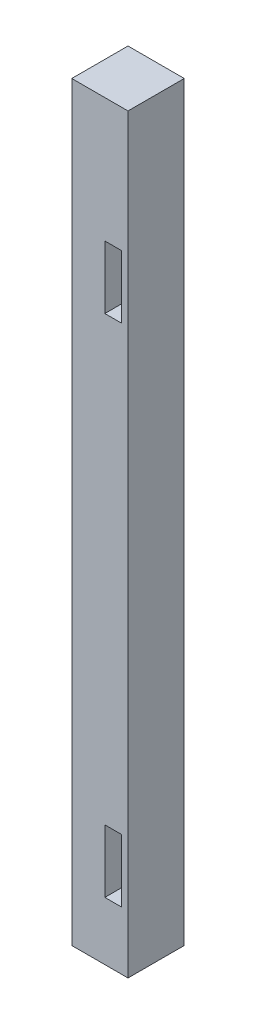
ISO-10303-21;
HEADER;
FILE_DESCRIPTION(('STEP AP214'),'2;1');
FILE_NAME('part.step','',(''),(''),'','','');
FILE_SCHEMA(('AUTOMOTIVE_DESIGN { 1 0 10303 214 1 1 1 1 }'));
ENDSEC;
DATA;
#1=APPLICATION_CONTEXT('core data for automotive mechanical design processes');
#2=APPLICATION_PROTOCOL_DEFINITION('international standard','automotive_design',2000,#1);
#3=PRODUCT_CONTEXT('',#1,'mechanical');
#4=PRODUCT('Part','Part','',(#3));
#5=PRODUCT_RELATED_PRODUCT_CATEGORY('part','',(#4));
#6=PRODUCT_DEFINITION_FORMATION('','',#4);
#7=PRODUCT_DEFINITION_CONTEXT('part definition',#1,'design');
#8=PRODUCT_DEFINITION('design','',#6,#7);
#9=PRODUCT_DEFINITION_SHAPE('','',#8);
#10=(LENGTH_UNIT() NAMED_UNIT(*) SI_UNIT(.MILLI.,.METRE.));
#11=(NAMED_UNIT(*) PLANE_ANGLE_UNIT() SI_UNIT($,.RADIAN.));
#12=(NAMED_UNIT(*) SI_UNIT($,.STERADIAN.) SOLID_ANGLE_UNIT());
#13=UNCERTAINTY_MEASURE_WITH_UNIT(LENGTH_MEASURE(1.E-05),#10,'distance_accuracy_value','');
#14=(GEOMETRIC_REPRESENTATION_CONTEXT(3) GLOBAL_UNCERTAINTY_ASSIGNED_CONTEXT((#13)) GLOBAL_UNIT_ASSIGNED_CONTEXT((#10,
#11,#12)) REPRESENTATION_CONTEXT('',''));
#15=CARTESIAN_POINT('',(0.,0.,0.));
#16=DIRECTION('',(0.,0.,1.));
#17=DIRECTION('',(1.,0.,0.));
#18=AXIS2_PLACEMENT_3D('',#15,#16,#17);
#19=CARTESIAN_POINT('',(4.25,113.5,-4.25));
#20=DIRECTION('',(-1.,0.,0.));
#21=DIRECTION('',(0.,0.,1.));
#22=AXIS2_PLACEMENT_3D('',#19,#20,#21);
#23=PLANE('',#22);
#24=DIRECTION('',(0.,0.,-1.));
#25=VECTOR('',#24,1.);
#26=CARTESIAN_POINT('',(4.25,0.,-4.25));
#27=LINE('',#26,#25);
#28=CARTESIAN_POINT('',(4.25,0.,4.25));
#29=VERTEX_POINT('',#28);
#30=CARTESIAN_POINT('',(4.25,0.,-4.25));
#31=VERTEX_POINT('',#30);
#32=EDGE_CURVE('E265',#29,#31,#27,.T.);
#33=ORIENTED_EDGE('',*,*,#32,.T.);
#34=DIRECTION('',(0.,-1.,0.));
#35=VECTOR('',#34,1.);
#36=CARTESIAN_POINT('',(4.25,113.5,-4.25));
#37=LINE('',#36,#35);
#38=CARTESIAN_POINT('',(4.25,113.5,-4.25));
#39=VERTEX_POINT('',#38);
#40=EDGE_CURVE('E11',#39,#31,#37,.T.);
#41=ORIENTED_EDGE('',*,*,#40,.F.);
#42=DIRECTION('',(0.,0.,-1.));
#43=VECTOR('',#42,1.);
#44=CARTESIAN_POINT('',(4.25,113.5,-4.25));
#45=LINE('',#44,#43);
#46=CARTESIAN_POINT('',(4.25,113.5,4.25));
#47=VERTEX_POINT('',#46);
#48=EDGE_CURVE('E302',#47,#39,#45,.T.);
#49=ORIENTED_EDGE('',*,*,#48,.F.);
#50=DIRECTION('',(0.,-1.,0.));
#51=VECTOR('',#50,1.);
#52=CARTESIAN_POINT('',(4.25,113.5,4.25));
#53=LINE('',#52,#51);
#54=EDGE_CURVE('E312',#47,#29,#53,.T.);
#55=ORIENTED_EDGE('',*,*,#54,.T.);
#56=EDGE_LOOP('',(#33,#41,#49,#55));
#57=FACE_BOUND('',#56,.T.);
#58=ADVANCED_FACE('F33',(#57),#23,.F.);
#59=CARTESIAN_POINT('',(-4.25,113.5,-4.25));
#60=DIRECTION('',(0.,0.,1.));
#61=DIRECTION('',(1.,0.,0.));
#62=AXIS2_PLACEMENT_3D('',#59,#60,#61);
#63=PLANE('',#62);
#64=DIRECTION('',(-1.,0.,0.));
#65=VECTOR('',#64,1.);
#66=CARTESIAN_POINT('',(-4.25,0.,-4.25));
#67=LINE('',#66,#65);
#68=CARTESIAN_POINT('',(-4.25,0.,-4.25));
#69=VERTEX_POINT('',#68);
#70=EDGE_CURVE('E315',#31,#69,#67,.T.);
#71=ORIENTED_EDGE('',*,*,#70,.T.);
#72=DIRECTION('',(0.,-1.,0.));
#73=VECTOR('',#72,1.);
#74=CARTESIAN_POINT('',(-4.25,113.5,-4.25));
#75=LINE('',#74,#73);
#76=CARTESIAN_POINT('',(-4.25,113.5,-4.25));
#77=VERTEX_POINT('',#76);
#78=EDGE_CURVE('E40',#77,#69,#75,.T.);
#79=ORIENTED_EDGE('',*,*,#78,.F.);
#80=DIRECTION('',(-1.,0.,0.));
#81=VECTOR('',#80,1.);
#82=CARTESIAN_POINT('',(-4.25,113.5,-4.25));
#83=LINE('',#82,#81);
#84=EDGE_CURVE('E305',#39,#77,#83,.T.);
#85=ORIENTED_EDGE('',*,*,#84,.F.);
#86=ORIENTED_EDGE('',*,*,#40,.T.);
#87=EDGE_LOOP('',(#71,#79,#85,#86));
#88=FACE_BOUND('',#87,.T.);
#89=ADVANCED_FACE('F345',(#88),#63,.F.);
#90=CARTESIAN_POINT('',(-4.25,113.5,-4.25));
#91=DIRECTION('',(1.,0.,0.));
#92=DIRECTION('',(0.,0.,-1.));
#93=AXIS2_PLACEMENT_3D('',#90,#91,#92);
#94=PLANE('',#93);
#95=DIRECTION('',(0.,0.,1.));
#96=VECTOR('',#95,1.);
#97=CARTESIAN_POINT('',(-4.25,95.2,-3.25));
#98=LINE('',#97,#96);
#99=CARTESIAN_POINT('',(-4.25,95.2,-3.25));
#100=VERTEX_POINT('',#99);
#101=CARTESIAN_POINT('',(-4.25,95.2,-0.749999999999999));
#102=VERTEX_POINT('',#101);
#103=EDGE_CURVE('E198',#100,#102,#98,.T.);
#104=ORIENTED_EDGE('',*,*,#103,.F.);
#105=DIRECTION('',(0.,-1.,0.));
#106=VECTOR('',#105,1.);
#107=CARTESIAN_POINT('',(-4.25,104.7,-3.25));
#108=LINE('',#107,#106);
#109=CARTESIAN_POINT('',(-4.25,104.7,-3.25));
#110=VERTEX_POINT('',#109);
#111=EDGE_CURVE('E47',#110,#100,#108,.T.);
#112=ORIENTED_EDGE('',*,*,#111,.F.);
#113=DIRECTION('',(0.,0.,-1.));
#114=VECTOR('',#113,1.);
#115=CARTESIAN_POINT('',(-4.25,104.7,-3.25));
#116=LINE('',#115,#114);
#117=CARTESIAN_POINT('',(-4.25,104.7,-0.750000000000001));
#118=VERTEX_POINT('',#117);
#119=EDGE_CURVE('E189',#118,#110,#116,.T.);
#120=ORIENTED_EDGE('',*,*,#119,.F.);
#121=DIRECTION('',(0.,1.,0.));
#122=VECTOR('',#121,1.);
#123=CARTESIAN_POINT('',(-4.25,104.7,-0.750000000000001));
#124=LINE('',#123,#122);
#125=EDGE_CURVE('E192',#102,#118,#124,.T.);
#126=ORIENTED_EDGE('',*,*,#125,.F.);
#127=EDGE_LOOP('',(#104,#112,#120,#126));
#128=FACE_BOUND('',#127,.T.);
#129=DIRECTION('',(0.,0.,1.));
#130=VECTOR('',#129,1.);
#131=CARTESIAN_POINT('',(-4.25,18.77,-3.25));
#132=LINE('',#131,#130);
#133=CARTESIAN_POINT('',(-4.25,18.77,-3.25));
#134=VERTEX_POINT('',#133);
#135=CARTESIAN_POINT('',(-4.25,18.77,-0.75));
#136=VERTEX_POINT('',#135);
#137=EDGE_CURVE('E224',#134,#136,#132,.T.);
#138=ORIENTED_EDGE('',*,*,#137,.F.);
#139=DIRECTION('',(0.,-1.,0.));
#140=VECTOR('',#139,1.);
#141=CARTESIAN_POINT('',(-4.25,28.27,-3.25));
#142=LINE('',#141,#140);
#143=CARTESIAN_POINT('',(-4.25,28.27,-3.25));
#144=VERTEX_POINT('',#143);
#145=EDGE_CURVE('E55',#144,#134,#142,.T.);
#146=ORIENTED_EDGE('',*,*,#145,.F.);
#147=DIRECTION('',(0.,0.,-1.));
#148=VECTOR('',#147,1.);
#149=CARTESIAN_POINT('',(-4.25,28.27,-3.25));
#150=LINE('',#149,#148);
#151=CARTESIAN_POINT('',(-4.25,28.27,-0.750000000000001));
#152=VERTEX_POINT('',#151);
#153=EDGE_CURVE('E213',#152,#144,#150,.T.);
#154=ORIENTED_EDGE('',*,*,#153,.F.);
#155=DIRECTION('',(0.,1.,0.));
#156=VECTOR('',#155,1.);
#157=CARTESIAN_POINT('',(-4.25,28.27,-0.750000000000001));
#158=LINE('',#157,#156);
#159=EDGE_CURVE('E227',#136,#152,#158,.T.);
#160=ORIENTED_EDGE('',*,*,#159,.F.);
#161=EDGE_LOOP('',(#138,#146,#154,#160));
#162=FACE_BOUND('',#161,.T.);
#163=DIRECTION('',(0.,0.,1.));
#164=VECTOR('',#163,1.);
#165=CARTESIAN_POINT('',(-4.25,0.,-4.25));
#166=LINE('',#165,#164);
#167=CARTESIAN_POINT('',(-4.25,0.,4.25));
#168=VERTEX_POINT('',#167);
#169=EDGE_CURVE('E317',#69,#168,#166,.T.);
#170=ORIENTED_EDGE('',*,*,#169,.T.);
#171=DIRECTION('',(0.,-1.,0.));
#172=VECTOR('',#171,1.);
#173=CARTESIAN_POINT('',(-4.25,113.5,4.25));
#174=LINE('',#173,#172);
#175=CARTESIAN_POINT('',(-4.25,113.5,4.25));
#176=VERTEX_POINT('',#175);
#177=EDGE_CURVE('E322',#176,#168,#174,.T.);
#178=ORIENTED_EDGE('',*,*,#177,.F.);
#179=DIRECTION('',(0.,0.,1.));
#180=VECTOR('',#179,1.);
#181=CARTESIAN_POINT('',(-4.25,113.5,-4.25));
#182=LINE('',#181,#180);
#183=EDGE_CURVE('E308',#77,#176,#182,.T.);
#184=ORIENTED_EDGE('',*,*,#183,.F.);
#185=ORIENTED_EDGE('',*,*,#78,.T.);
#186=EDGE_LOOP('',(#170,#178,#184,#185));
#187=FACE_BOUND('',#186,.T.);
#188=ADVANCED_FACE('F329',(#128,#162,#187),#94,.F.);
#189=CARTESIAN_POINT('',(-4.25,113.5,4.25));
#190=DIRECTION('',(0.,0.,-1.));
#191=DIRECTION('',(-1.,0.,0.));
#192=AXIS2_PLACEMENT_3D('',#189,#190,#191);
#193=PLANE('',#192);
#194=DIRECTION('',(-1.,0.,0.));
#195=VECTOR('',#194,1.);
#196=CARTESIAN_POINT('',(3.25,18.3,4.25));
#197=LINE('',#196,#195);
#198=CARTESIAN_POINT('',(3.25,18.3,4.25));
#199=VERTEX_POINT('',#198);
#200=CARTESIAN_POINT('',(0.750000000000003,18.3,4.25));
#201=VERTEX_POINT('',#200);
#202=EDGE_CURVE('E254',#199,#201,#197,.T.);
#203=ORIENTED_EDGE('',*,*,#202,.F.);
#204=DIRECTION('',(0.,1.,0.));
#205=VECTOR('',#204,1.);
#206=CARTESIAN_POINT('',(3.25,18.3,4.25));
#207=LINE('',#206,#205);
#208=CARTESIAN_POINT('',(3.25,8.8,4.25));
#209=VERTEX_POINT('',#208);
#210=EDGE_CURVE('E252',#209,#199,#207,.T.);
#211=ORIENTED_EDGE('',*,*,#210,.F.);
#212=DIRECTION('',(1.,0.,0.));
#213=VECTOR('',#212,1.);
#214=CARTESIAN_POINT('',(3.25,8.8,4.25));
#215=LINE('',#214,#213);
#216=CARTESIAN_POINT('',(0.750000000000003,8.8,4.25));
#217=VERTEX_POINT('',#216);
#218=EDGE_CURVE('E242',#217,#209,#215,.T.);
#219=ORIENTED_EDGE('',*,*,#218,.F.);
#220=DIRECTION('',(0.,-1.,0.));
#221=VECTOR('',#220,1.);
#222=CARTESIAN_POINT('',(0.750000000000003,18.3,4.25));
#223=LINE('',#222,#221);
#224=EDGE_CURVE('E258',#201,#217,#223,.T.);
#225=ORIENTED_EDGE('',*,*,#224,.F.);
#226=EDGE_LOOP('',(#203,#211,#219,#225));
#227=FACE_BOUND('',#226,.T.);
#228=DIRECTION('',(1.,0.,0.));
#229=VECTOR('',#228,1.);
#230=CARTESIAN_POINT('',(0.750000000000003,85.23,4.25));
#231=LINE('',#230,#229);
#232=CARTESIAN_POINT('',(0.750000000000003,85.23,4.25));
#233=VERTEX_POINT('',#232);
#234=CARTESIAN_POINT('',(3.25,85.23,4.25));
#235=VERTEX_POINT('',#234);
#236=EDGE_CURVE('E287',#233,#235,#231,.T.);
#237=ORIENTED_EDGE('',*,*,#236,.F.);
#238=DIRECTION('',(0.,-1.,0.));
#239=VECTOR('',#238,1.);
#240=CARTESIAN_POINT('',(0.750000000000002,94.73,4.25));
#241=LINE('',#240,#239);
#242=CARTESIAN_POINT('',(0.750000000000002,94.73,4.25));
#243=VERTEX_POINT('',#242);
#244=EDGE_CURVE('E205',#243,#233,#241,.T.);
#245=ORIENTED_EDGE('',*,*,#244,.F.);
#246=DIRECTION('',(-1.,0.,0.));
#247=VECTOR('',#246,1.);
#248=CARTESIAN_POINT('',(0.750000000000002,94.73,4.25));
#249=LINE('',#248,#247);
#250=CARTESIAN_POINT('',(3.25,94.73,4.25));
#251=VERTEX_POINT('',#250);
#252=EDGE_CURVE('E276',#251,#243,#249,.T.);
#253=ORIENTED_EDGE('',*,*,#252,.F.);
#254=DIRECTION('',(0.,1.,0.));
#255=VECTOR('',#254,1.);
#256=CARTESIAN_POINT('',(3.25,94.73,4.25));
#257=LINE('',#256,#255);
#258=EDGE_CURVE('E290',#235,#251,#257,.T.);
#259=ORIENTED_EDGE('',*,*,#258,.F.);
#260=EDGE_LOOP('',(#237,#245,#253,#259));
#261=FACE_BOUND('',#260,.T.);
#262=DIRECTION('',(1.,0.,0.));
#263=VECTOR('',#262,1.);
#264=CARTESIAN_POINT('',(-4.25,0.,4.25));
#265=LINE('',#264,#263);
#266=EDGE_CURVE('E306',#168,#29,#265,.T.);
#267=ORIENTED_EDGE('',*,*,#266,.T.);
#268=ORIENTED_EDGE('',*,*,#54,.F.);
#269=DIRECTION('',(1.,0.,0.));
#270=VECTOR('',#269,1.);
#271=CARTESIAN_POINT('',(-4.25,113.5,4.25));
#272=LINE('',#271,#270);
#273=EDGE_CURVE('E310',#176,#47,#272,.T.);
#274=ORIENTED_EDGE('',*,*,#273,.F.);
#275=ORIENTED_EDGE('',*,*,#177,.T.);
#276=EDGE_LOOP('',(#267,#268,#274,#275));
#277=FACE_BOUND('',#276,.T.);
#278=ADVANCED_FACE('F338',(#227,#261,#277),#193,.F.);
#279=CARTESIAN_POINT('',(0.,113.5,0.));
#280=DIRECTION('',(0.,1.,0.));
#281=DIRECTION('',(0.,0.,1.));
#282=AXIS2_PLACEMENT_3D('',#279,#280,#281);
#283=PLANE('',#282);
#284=ORIENTED_EDGE('',*,*,#48,.T.);
#285=ORIENTED_EDGE('',*,*,#84,.T.);
#286=ORIENTED_EDGE('',*,*,#183,.T.);
#287=ORIENTED_EDGE('',*,*,#273,.T.);
#288=EDGE_LOOP('',(#284,#285,#286,#287));
#289=FACE_BOUND('',#288,.T.);
#290=ADVANCED_FACE('F344',(#289),#283,.T.);
#291=CARTESIAN_POINT('',(0.,0.,0.));
#292=DIRECTION('',(0.,1.,0.));
#293=DIRECTION('',(0.,0.,1.));
#294=AXIS2_PLACEMENT_3D('',#291,#292,#293);
#295=PLANE('',#294);
#296=ORIENTED_EDGE('',*,*,#32,.F.);
#297=ORIENTED_EDGE('',*,*,#266,.F.);
#298=ORIENTED_EDGE('',*,*,#169,.F.);
#299=ORIENTED_EDGE('',*,*,#70,.F.);
#300=EDGE_LOOP('',(#296,#297,#298,#299));
#301=FACE_BOUND('',#300,.T.);
#302=ADVANCED_FACE('F335',(#301),#295,.F.);
#303=CARTESIAN_POINT('',(0.750000000000002,94.73,-0.750000000000002));
#304=DIRECTION('',(-1.,0.,0.));
#305=DIRECTION('',(0.,-1.,0.));
#306=AXIS2_PLACEMENT_3D('',#303,#304,#305);
#307=PLANE('',#306);
#308=ORIENTED_EDGE('',*,*,#244,.T.);
#309=DIRECTION('',(0.,0.,1.));
#310=VECTOR('',#309,1.);
#311=CARTESIAN_POINT('',(0.750000000000003,85.23,-0.750000000000002));
#312=LINE('',#311,#310);
#313=CARTESIAN_POINT('',(0.750000000000003,85.23,-0.750000000000002));
#314=VERTEX_POINT('',#313);
#315=EDGE_CURVE('E285',#314,#233,#312,.T.);
#316=ORIENTED_EDGE('',*,*,#315,.F.);
#317=DIRECTION('',(0.,-1.,0.));
#318=VECTOR('',#317,1.);
#319=CARTESIAN_POINT('',(0.750000000000002,94.73,-0.750000000000002));
#320=LINE('',#319,#318);
#321=CARTESIAN_POINT('',(0.750000000000002,94.73,-0.750000000000002));
#322=VERTEX_POINT('',#321);
#323=EDGE_CURVE('E272',#322,#314,#320,.T.);
#324=ORIENTED_EDGE('',*,*,#323,.F.);
#325=DIRECTION('',(0.,0.,1.));
#326=VECTOR('',#325,1.);
#327=CARTESIAN_POINT('',(0.750000000000002,94.73,-0.750000000000002));
#328=LINE('',#327,#326);
#329=EDGE_CURVE('E255',#322,#243,#328,.T.);
#330=ORIENTED_EDGE('',*,*,#329,.T.);
#331=EDGE_LOOP('',(#308,#316,#324,#330));
#332=FACE_BOUND('',#331,.T.);
#333=ADVANCED_FACE('F359',(#332),#307,.F.);
#334=CARTESIAN_POINT('',(0.750000000000002,94.73,-0.750000000000002));
#335=DIRECTION('',(0.,1.,0.));
#336=DIRECTION('',(0.,0.,1.));
#337=AXIS2_PLACEMENT_3D('',#334,#335,#336);
#338=PLANE('',#337);
#339=ORIENTED_EDGE('',*,*,#252,.T.);
#340=ORIENTED_EDGE('',*,*,#329,.F.);
#341=DIRECTION('',(-1.,0.,0.));
#342=VECTOR('',#341,1.);
#343=CARTESIAN_POINT('',(0.750000000000002,94.73,-0.750000000000002));
#344=LINE('',#343,#342);
#345=CARTESIAN_POINT('',(3.25,94.73,-0.750000000000002));
#346=VERTEX_POINT('',#345);
#347=EDGE_CURVE('E282',#346,#322,#344,.T.);
#348=ORIENTED_EDGE('',*,*,#347,.F.);
#349=DIRECTION('',(0.,0.,1.));
#350=VECTOR('',#349,1.);
#351=CARTESIAN_POINT('',(3.25,94.73,-0.750000000000002));
#352=LINE('',#351,#350);
#353=EDGE_CURVE('E296',#346,#251,#352,.T.);
#354=ORIENTED_EDGE('',*,*,#353,.T.);
#355=EDGE_LOOP('',(#339,#340,#348,#354));
#356=FACE_BOUND('',#355,.T.);
#357=ADVANCED_FACE('F364',(#356),#338,.F.);
#358=CARTESIAN_POINT('',(3.25,94.73,-0.750000000000002));
#359=DIRECTION('',(1.,0.,0.));
#360=DIRECTION('',(0.,1.,0.));
#361=AXIS2_PLACEMENT_3D('',#358,#359,#360);
#362=PLANE('',#361);
#363=ORIENTED_EDGE('',*,*,#258,.T.);
#364=ORIENTED_EDGE('',*,*,#353,.F.);
#365=DIRECTION('',(0.,1.,0.));
#366=VECTOR('',#365,1.);
#367=CARTESIAN_POINT('',(3.25,94.73,-0.750000000000002));
#368=LINE('',#367,#366);
#369=CARTESIAN_POINT('',(3.25,85.23,-0.750000000000002));
#370=VERTEX_POINT('',#369);
#371=EDGE_CURVE('E279',#370,#346,#368,.T.);
#372=ORIENTED_EDGE('',*,*,#371,.F.);
#373=DIRECTION('',(0.,0.,1.));
#374=VECTOR('',#373,1.);
#375=CARTESIAN_POINT('',(3.25,85.23,-0.750000000000002));
#376=LINE('',#375,#374);
#377=EDGE_CURVE('E298',#370,#235,#376,.T.);
#378=ORIENTED_EDGE('',*,*,#377,.T.);
#379=EDGE_LOOP('',(#363,#364,#372,#378));
#380=FACE_BOUND('',#379,.T.);
#381=ADVANCED_FACE('F370',(#380),#362,.F.);
#382=CARTESIAN_POINT('',(0.750000000000003,85.23,-0.750000000000002));
#383=DIRECTION('',(0.,-1.,0.));
#384=DIRECTION('',(0.,0.,-1.));
#385=AXIS2_PLACEMENT_3D('',#382,#383,#384);
#386=PLANE('',#385);
#387=ORIENTED_EDGE('',*,*,#236,.T.);
#388=ORIENTED_EDGE('',*,*,#377,.F.);
#389=DIRECTION('',(1.,0.,0.));
#390=VECTOR('',#389,1.);
#391=CARTESIAN_POINT('',(0.750000000000003,85.23,-0.750000000000002));
#392=LINE('',#391,#390);
#393=EDGE_CURVE('E275',#314,#370,#392,.T.);
#394=ORIENTED_EDGE('',*,*,#393,.F.);
#395=ORIENTED_EDGE('',*,*,#315,.T.);
#396=EDGE_LOOP('',(#387,#388,#394,#395));
#397=FACE_BOUND('',#396,.T.);
#398=ADVANCED_FACE('F366',(#397),#386,.F.);
#399=CARTESIAN_POINT('',(0.,0.,-0.750000000000002));
#400=DIRECTION('',(0.,0.,1.));
#401=DIRECTION('',(1.,0.,0.));
#402=AXIS2_PLACEMENT_3D('',#399,#400,#401);
#403=PLANE('',#402);
#404=ORIENTED_EDGE('',*,*,#323,.T.);
#405=ORIENTED_EDGE('',*,*,#393,.T.);
#406=ORIENTED_EDGE('',*,*,#371,.T.);
#407=ORIENTED_EDGE('',*,*,#347,.T.);
#408=EDGE_LOOP('',(#404,#405,#406,#407));
#409=FACE_BOUND('',#408,.T.);
#410=ADVANCED_FACE('F369',(#409),#403,.T.);
#411=CARTESIAN_POINT('',(3.25,18.3,-0.750000000000002));
#412=DIRECTION('',(1.,0.,0.));
#413=DIRECTION('',(0.,0.,-1.));
#414=AXIS2_PLACEMENT_3D('',#411,#412,#413);
#415=PLANE('',#414);
#416=ORIENTED_EDGE('',*,*,#210,.T.);
#417=DIRECTION('',(0.,0.,1.));
#418=VECTOR('',#417,1.);
#419=CARTESIAN_POINT('',(3.25,18.3,-0.750000000000002));
#420=LINE('',#419,#418);
#421=CARTESIAN_POINT('',(3.25,18.3,-0.750000000000002));
#422=VERTEX_POINT('',#421);
#423=EDGE_CURVE('E251',#422,#199,#420,.T.);
#424=ORIENTED_EDGE('',*,*,#423,.F.);
#425=DIRECTION('',(0.,1.,0.));
#426=VECTOR('',#425,1.);
#427=CARTESIAN_POINT('',(3.25,18.3,-0.750000000000002));
#428=LINE('',#427,#426);
#429=CARTESIAN_POINT('',(3.25,8.8,-0.750000000000002));
#430=VERTEX_POINT('',#429);
#431=EDGE_CURVE('E238',#430,#422,#428,.T.);
#432=ORIENTED_EDGE('',*,*,#431,.F.);
#433=DIRECTION('',(0.,0.,1.));
#434=VECTOR('',#433,1.);
#435=CARTESIAN_POINT('',(3.25,8.8,-0.750000000000002));
#436=LINE('',#435,#434);
#437=EDGE_CURVE('E263',#430,#209,#436,.T.);
#438=ORIENTED_EDGE('',*,*,#437,.T.);
#439=EDGE_LOOP('',(#416,#424,#432,#438));
#440=FACE_BOUND('',#439,.T.);
#441=ADVANCED_FACE('F380',(#440),#415,.F.);
#442=CARTESIAN_POINT('',(3.25,8.8,-0.750000000000002));
#443=DIRECTION('',(0.,-1.,0.));
#444=DIRECTION('',(0.,0.,-1.));
#445=AXIS2_PLACEMENT_3D('',#442,#443,#444);
#446=PLANE('',#445);
#447=ORIENTED_EDGE('',*,*,#218,.T.);
#448=ORIENTED_EDGE('',*,*,#437,.F.);
#449=DIRECTION('',(1.,0.,0.));
#450=VECTOR('',#449,1.);
#451=CARTESIAN_POINT('',(3.25,8.8,-0.750000000000002));
#452=LINE('',#451,#450);
#453=CARTESIAN_POINT('',(0.750000000000003,8.8,-0.750000000000002));
#454=VERTEX_POINT('',#453);
#455=EDGE_CURVE('E248',#454,#430,#452,.T.);
#456=ORIENTED_EDGE('',*,*,#455,.F.);
#457=DIRECTION('',(0.,0.,1.));
#458=VECTOR('',#457,1.);
#459=CARTESIAN_POINT('',(0.750000000000003,8.8,-0.750000000000002));
#460=LINE('',#459,#458);
#461=EDGE_CURVE('E266',#454,#217,#460,.T.);
#462=ORIENTED_EDGE('',*,*,#461,.T.);
#463=EDGE_LOOP('',(#447,#448,#456,#462));
#464=FACE_BOUND('',#463,.T.);
#465=ADVANCED_FACE('F384',(#464),#446,.F.);
#466=CARTESIAN_POINT('',(0.750000000000003,18.3,-0.750000000000002));
#467=DIRECTION('',(-1.,0.,0.));
#468=DIRECTION('',(0.,-1.,0.));
#469=AXIS2_PLACEMENT_3D('',#466,#467,#468);
#470=PLANE('',#469);
#471=ORIENTED_EDGE('',*,*,#224,.T.);
#472=ORIENTED_EDGE('',*,*,#461,.F.);
#473=DIRECTION('',(0.,-1.,0.));
#474=VECTOR('',#473,1.);
#475=CARTESIAN_POINT('',(0.750000000000003,18.3,-0.750000000000002));
#476=LINE('',#475,#474);
#477=CARTESIAN_POINT('',(0.750000000000003,18.3,-0.750000000000002));
#478=VERTEX_POINT('',#477);
#479=EDGE_CURVE('E245',#478,#454,#476,.T.);
#480=ORIENTED_EDGE('',*,*,#479,.F.);
#481=DIRECTION('',(0.,0.,1.));
#482=VECTOR('',#481,1.);
#483=CARTESIAN_POINT('',(0.750000000000003,18.3,-0.750000000000002));
#484=LINE('',#483,#482);
#485=EDGE_CURVE('E268',#478,#201,#484,.T.);
#486=ORIENTED_EDGE('',*,*,#485,.T.);
#487=EDGE_LOOP('',(#471,#472,#480,#486));
#488=FACE_BOUND('',#487,.T.);
#489=ADVANCED_FACE('F390',(#488),#470,.F.);
#490=CARTESIAN_POINT('',(3.25,18.3,-0.750000000000002));
#491=DIRECTION('',(0.,1.,0.));
#492=DIRECTION('',(0.,0.,1.));
#493=AXIS2_PLACEMENT_3D('',#490,#491,#492);
#494=PLANE('',#493);
#495=ORIENTED_EDGE('',*,*,#202,.T.);
#496=ORIENTED_EDGE('',*,*,#485,.F.);
#497=DIRECTION('',(-1.,0.,0.));
#498=VECTOR('',#497,1.);
#499=CARTESIAN_POINT('',(3.25,18.3,-0.750000000000002));
#500=LINE('',#499,#498);
#501=EDGE_CURVE('E241',#422,#478,#500,.T.);
#502=ORIENTED_EDGE('',*,*,#501,.F.);
#503=ORIENTED_EDGE('',*,*,#423,.T.);
#504=EDGE_LOOP('',(#495,#496,#502,#503));
#505=FACE_BOUND('',#504,.T.);
#506=ADVANCED_FACE('F386',(#505),#494,.F.);
#507=CARTESIAN_POINT('',(0.,0.,-0.750000000000002));
#508=DIRECTION('',(0.,0.,-1.));
#509=DIRECTION('',(-1.,0.,0.));
#510=AXIS2_PLACEMENT_3D('',#507,#508,#509);
#511=PLANE('',#510);
#512=ORIENTED_EDGE('',*,*,#431,.T.);
#513=ORIENTED_EDGE('',*,*,#501,.T.);
#514=ORIENTED_EDGE('',*,*,#479,.T.);
#515=ORIENTED_EDGE('',*,*,#455,.T.);
#516=EDGE_LOOP('',(#512,#513,#514,#515));
#517=FACE_BOUND('',#516,.T.);
#518=ADVANCED_FACE('F389',(#517),#511,.F.);
#519=CARTESIAN_POINT('',(0.75,28.27,-3.25));
#520=DIRECTION('',(0.,0.,-1.));
#521=DIRECTION('',(-1.,0.,0.));
#522=AXIS2_PLACEMENT_3D('',#519,#520,#521);
#523=PLANE('',#522);
#524=ORIENTED_EDGE('',*,*,#145,.T.);
#525=DIRECTION('',(-1.,0.,0.));
#526=VECTOR('',#525,1.);
#527=CARTESIAN_POINT('',(0.75,18.77,-3.25));
#528=LINE('',#527,#526);
#529=CARTESIAN_POINT('',(0.75,18.77,-3.25));
#530=VERTEX_POINT('',#529);
#531=EDGE_CURVE('E222',#530,#134,#528,.T.);
#532=ORIENTED_EDGE('',*,*,#531,.F.);
#533=DIRECTION('',(0.,-1.,0.));
#534=VECTOR('',#533,1.);
#535=CARTESIAN_POINT('',(0.75,28.27,-3.25));
#536=LINE('',#535,#534);
#537=CARTESIAN_POINT('',(0.75,28.27,-3.25));
#538=VERTEX_POINT('',#537);
#539=EDGE_CURVE('E209',#538,#530,#536,.T.);
#540=ORIENTED_EDGE('',*,*,#539,.F.);
#541=DIRECTION('',(-1.,0.,0.));
#542=VECTOR('',#541,1.);
#543=CARTESIAN_POINT('',(0.75,28.27,-3.25));
#544=LINE('',#543,#542);
#545=EDGE_CURVE('E199',#538,#144,#544,.T.);
#546=ORIENTED_EDGE('',*,*,#545,.T.);
#547=EDGE_LOOP('',(#524,#532,#540,#546));
#548=FACE_BOUND('',#547,.T.);
#549=ADVANCED_FACE('F400',(#548),#523,.F.);
#550=CARTESIAN_POINT('',(0.75,28.27,-3.25));
#551=DIRECTION('',(0.,1.,0.));
#552=DIRECTION('',(0.,0.,1.));
#553=AXIS2_PLACEMENT_3D('',#550,#551,#552);
#554=PLANE('',#553);
#555=ORIENTED_EDGE('',*,*,#153,.T.);
#556=ORIENTED_EDGE('',*,*,#545,.F.);
#557=DIRECTION('',(0.,0.,-1.));
#558=VECTOR('',#557,1.);
#559=CARTESIAN_POINT('',(0.75,28.27,-3.25));
#560=LINE('',#559,#558);
#561=CARTESIAN_POINT('',(0.750000000000001,28.27,-0.750000000000002));
#562=VERTEX_POINT('',#561);
#563=EDGE_CURVE('E219',#562,#538,#560,.T.);
#564=ORIENTED_EDGE('',*,*,#563,.F.);
#565=DIRECTION('',(-1.,0.,0.));
#566=VECTOR('',#565,1.);
#567=CARTESIAN_POINT('',(0.750000000000001,28.27,-0.750000000000002));
#568=LINE('',#567,#566);
#569=EDGE_CURVE('E233',#562,#152,#568,.T.);
#570=ORIENTED_EDGE('',*,*,#569,.T.);
#571=EDGE_LOOP('',(#555,#556,#564,#570));
#572=FACE_BOUND('',#571,.T.);
#573=ADVANCED_FACE('F404',(#572),#554,.F.);
#574=CARTESIAN_POINT('',(0.750000000000001,28.27,-0.750000000000002));
#575=DIRECTION('',(0.,0.,1.));
#576=DIRECTION('',(1.,0.,0.));
#577=AXIS2_PLACEMENT_3D('',#574,#575,#576);
#578=PLANE('',#577);
#579=ORIENTED_EDGE('',*,*,#159,.T.);
#580=ORIENTED_EDGE('',*,*,#569,.F.);
#581=DIRECTION('',(0.,1.,0.));
#582=VECTOR('',#581,1.);
#583=CARTESIAN_POINT('',(0.750000000000001,28.27,-0.750000000000002));
#584=LINE('',#583,#582);
#585=CARTESIAN_POINT('',(0.750000000000001,18.77,-0.750000000000001));
#586=VERTEX_POINT('',#585);
#587=EDGE_CURVE('E216',#586,#562,#584,.T.);
#588=ORIENTED_EDGE('',*,*,#587,.F.);
#589=DIRECTION('',(-1.,0.,0.));
#590=VECTOR('',#589,1.);
#591=CARTESIAN_POINT('',(0.750000000000001,18.77,-0.750000000000001));
#592=LINE('',#591,#590);
#593=EDGE_CURVE('E235',#586,#136,#592,.T.);
#594=ORIENTED_EDGE('',*,*,#593,.T.);
#595=EDGE_LOOP('',(#579,#580,#588,#594));
#596=FACE_BOUND('',#595,.T.);
#597=ADVANCED_FACE('F409',(#596),#578,.F.);
#598=CARTESIAN_POINT('',(0.75,18.77,-3.25));
#599=DIRECTION('',(0.,-1.,0.));
#600=DIRECTION('',(0.,0.,-1.));
#601=AXIS2_PLACEMENT_3D('',#598,#599,#600);
#602=PLANE('',#601);
#603=ORIENTED_EDGE('',*,*,#137,.T.);
#604=ORIENTED_EDGE('',*,*,#593,.F.);
#605=DIRECTION('',(0.,0.,1.));
#606=VECTOR('',#605,1.);
#607=CARTESIAN_POINT('',(0.75,18.77,-3.25));
#608=LINE('',#607,#606);
#609=EDGE_CURVE('E212',#530,#586,#608,.T.);
#610=ORIENTED_EDGE('',*,*,#609,.F.);
#611=ORIENTED_EDGE('',*,*,#531,.T.);
#612=EDGE_LOOP('',(#603,#604,#610,#611));
#613=FACE_BOUND('',#612,.T.);
#614=ADVANCED_FACE('F405',(#613),#602,.F.);
#615=CARTESIAN_POINT('',(0.750000000000001,0.,0.));
#616=DIRECTION('',(-1.,0.,0.));
#617=DIRECTION('',(0.,0.,1.));
#618=AXIS2_PLACEMENT_3D('',#615,#616,#617);
#619=PLANE('',#618);
#620=ORIENTED_EDGE('',*,*,#539,.T.);
#621=ORIENTED_EDGE('',*,*,#609,.T.);
#622=ORIENTED_EDGE('',*,*,#587,.T.);
#623=ORIENTED_EDGE('',*,*,#563,.T.);
#624=EDGE_LOOP('',(#620,#621,#622,#623));
#625=FACE_BOUND('',#624,.T.);
#626=ADVANCED_FACE('F408',(#625),#619,.T.);
#627=CARTESIAN_POINT('',(0.75,104.7,-3.25));
#628=DIRECTION('',(0.,0.,-1.));
#629=DIRECTION('',(-1.,0.,0.));
#630=AXIS2_PLACEMENT_3D('',#627,#628,#629);
#631=PLANE('',#630);
#632=ORIENTED_EDGE('',*,*,#111,.T.);
#633=DIRECTION('',(-1.,0.,0.));
#634=VECTOR('',#633,1.);
#635=CARTESIAN_POINT('',(0.75,95.2,-3.25));
#636=LINE('',#635,#634);
#637=CARTESIAN_POINT('',(0.75,95.2,-3.25));
#638=VERTEX_POINT('',#637);
#639=EDGE_CURVE('E167',#638,#100,#636,.T.);
#640=ORIENTED_EDGE('',*,*,#639,.F.);
#641=DIRECTION('',(0.,-1.,0.));
#642=VECTOR('',#641,1.);
#643=CARTESIAN_POINT('',(0.75,104.7,-3.25));
#644=LINE('',#643,#642);
#645=CARTESIAN_POINT('',(0.75,104.7,-3.25));
#646=VERTEX_POINT('',#645);
#647=EDGE_CURVE('E171',#646,#638,#644,.T.);
#648=ORIENTED_EDGE('',*,*,#647,.F.);
#649=DIRECTION('',(-1.,0.,0.));
#650=VECTOR('',#649,1.);
#651=CARTESIAN_POINT('',(0.75,104.7,-3.25));
#652=LINE('',#651,#650);
#653=EDGE_CURVE('E203',#646,#110,#652,.T.);
#654=ORIENTED_EDGE('',*,*,#653,.T.);
#655=EDGE_LOOP('',(#632,#640,#648,#654));
#656=FACE_BOUND('',#655,.T.);
#657=ADVANCED_FACE('F169',(#656),#631,.F.);
#658=CARTESIAN_POINT('',(0.75,104.7,-3.25));
#659=DIRECTION('',(0.,1.,0.));
#660=DIRECTION('',(0.,0.,1.));
#661=AXIS2_PLACEMENT_3D('',#658,#659,#660);
#662=PLANE('',#661);
#663=ORIENTED_EDGE('',*,*,#119,.T.);
#664=ORIENTED_EDGE('',*,*,#653,.F.);
#665=DIRECTION('',(0.,0.,-1.));
#666=VECTOR('',#665,1.);
#667=CARTESIAN_POINT('',(0.75,104.7,-3.25));
#668=LINE('',#667,#666);
#669=CARTESIAN_POINT('',(0.750000000000001,104.7,-0.750000000000002));
#670=VERTEX_POINT('',#669);
#671=EDGE_CURVE('E177',#670,#646,#668,.T.);
#672=ORIENTED_EDGE('',*,*,#671,.F.);
#673=DIRECTION('',(-1.,0.,0.));
#674=VECTOR('',#673,1.);
#675=CARTESIAN_POINT('',(0.750000000000001,104.7,-0.750000000000002));
#676=LINE('',#675,#674);
#677=EDGE_CURVE('E206',#670,#118,#676,.T.);
#678=ORIENTED_EDGE('',*,*,#677,.T.);
#679=EDGE_LOOP('',(#663,#664,#672,#678));
#680=FACE_BOUND('',#679,.T.);
#681=ADVANCED_FACE('F422',(#680),#662,.F.);
#682=CARTESIAN_POINT('',(0.750000000000001,104.7,-0.750000000000002));
#683=DIRECTION('',(0.,0.,1.));
#684=DIRECTION('',(1.,0.,0.));
#685=AXIS2_PLACEMENT_3D('',#682,#683,#684);
#686=PLANE('',#685);
#687=ORIENTED_EDGE('',*,*,#125,.T.);
#688=ORIENTED_EDGE('',*,*,#677,.F.);
#689=DIRECTION('',(0.,1.,0.));
#690=VECTOR('',#689,1.);
#691=CARTESIAN_POINT('',(0.750000000000001,104.7,-0.750000000000002));
#692=LINE('',#691,#690);
#693=CARTESIAN_POINT('',(0.750000000000001,95.2,-0.75));
#694=VERTEX_POINT('',#693);
#695=EDGE_CURVE('E185',#694,#670,#692,.T.);
#696=ORIENTED_EDGE('',*,*,#695,.F.);
#697=DIRECTION('',(-1.,0.,0.));
#698=VECTOR('',#697,1.);
#699=CARTESIAN_POINT('',(0.750000000000001,95.2,-0.75));
#700=LINE('',#699,#698);
#701=EDGE_CURVE('E176',#694,#102,#700,.T.);
#702=ORIENTED_EDGE('',*,*,#701,.T.);
#703=EDGE_LOOP('',(#687,#688,#696,#702));
#704=FACE_BOUND('',#703,.T.);
#705=ADVANCED_FACE('F425',(#704),#686,.F.);
#706=CARTESIAN_POINT('',(0.75,95.2,-3.25));
#707=DIRECTION('',(0.,-1.,0.));
#708=DIRECTION('',(0.,0.,-1.));
#709=AXIS2_PLACEMENT_3D('',#706,#707,#708);
#710=PLANE('',#709);
#711=ORIENTED_EDGE('',*,*,#103,.T.);
#712=ORIENTED_EDGE('',*,*,#701,.F.);
#713=DIRECTION('',(0.,0.,1.));
#714=VECTOR('',#713,1.);
#715=CARTESIAN_POINT('',(0.75,95.2,-3.25));
#716=LINE('',#715,#714);
#717=EDGE_CURVE('E180',#638,#694,#716,.T.);
#718=ORIENTED_EDGE('',*,*,#717,.F.);
#719=ORIENTED_EDGE('',*,*,#639,.T.);
#720=EDGE_LOOP('',(#711,#712,#718,#719));
#721=FACE_BOUND('',#720,.T.);
#722=ADVANCED_FACE('F181',(#721),#710,.F.);
#723=CARTESIAN_POINT('',(0.750000000000001,0.,0.));
#724=DIRECTION('',(-1.,0.,0.));
#725=DIRECTION('',(0.,0.,1.));
#726=AXIS2_PLACEMENT_3D('',#723,#724,#725);
#727=PLANE('',#726);
#728=ORIENTED_EDGE('',*,*,#647,.T.);
#729=ORIENTED_EDGE('',*,*,#717,.T.);
#730=ORIENTED_EDGE('',*,*,#695,.T.);
#731=ORIENTED_EDGE('',*,*,#671,.T.);
#732=EDGE_LOOP('',(#728,#729,#730,#731));
#733=FACE_BOUND('',#732,.T.);
#734=ADVANCED_FACE('F187',(#733),#727,.T.);
#735=CLOSED_SHELL('',(#58,#89,#188,#278,#290,#302,#333,#357,#381,#398,#410,#441,#465,#489,#506,
#518,#549,#573,#597,#614,#626,#657,#681,#705,#722,#734));
#736=MANIFOLD_SOLID_BREP('B2',#735);
#737=ADVANCED_BREP_SHAPE_REPRESENTATION('',(#18,#736),#14);
#738=SHAPE_DEFINITION_REPRESENTATION(#9,#737);
ENDSEC;
END-ISO-10303-21;
